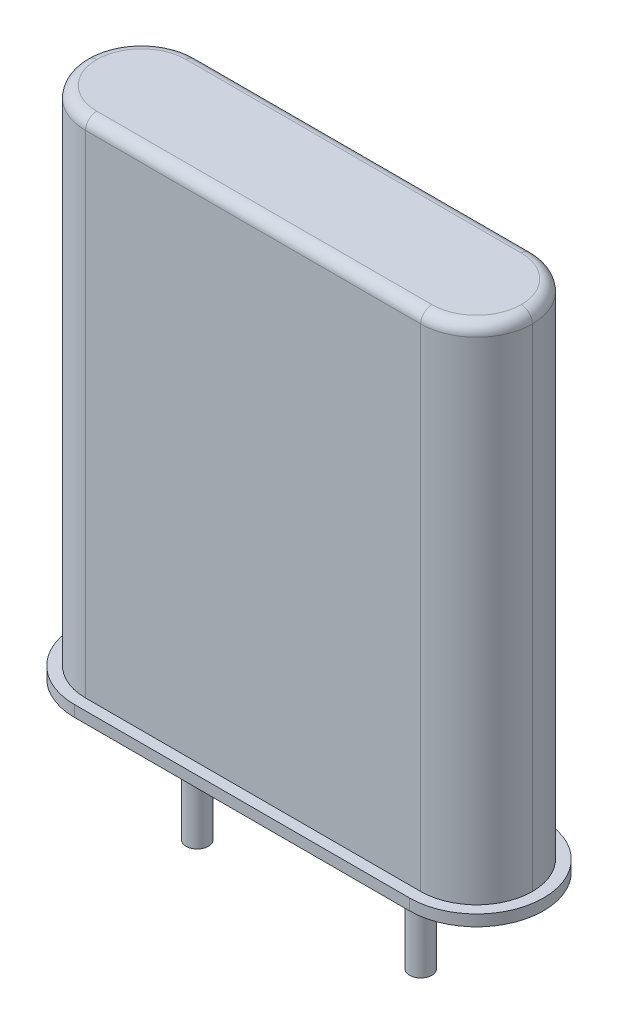
ISO-10303-21;
HEADER;
FILE_DESCRIPTION(('STEP AP214'),'2;1');
FILE_NAME('part.step','',(''),(''),'','','');
FILE_SCHEMA(('AUTOMOTIVE_DESIGN { 1 0 10303 214 1 1 1 1 }'));
ENDSEC;
DATA;
#1=APPLICATION_CONTEXT('core data for automotive mechanical design processes');
#2=APPLICATION_PROTOCOL_DEFINITION('international standard','automotive_design',2000,#1);
#3=PRODUCT_CONTEXT('',#1,'mechanical');
#4=PRODUCT('Part','Part','',(#3));
#5=PRODUCT_RELATED_PRODUCT_CATEGORY('part','',(#4));
#6=PRODUCT_DEFINITION_FORMATION('','',#4);
#7=PRODUCT_DEFINITION_CONTEXT('part definition',#1,'design');
#8=PRODUCT_DEFINITION('design','',#6,#7);
#9=PRODUCT_DEFINITION_SHAPE('','',#8);
#10=(LENGTH_UNIT() NAMED_UNIT(*) SI_UNIT(.MILLI.,.METRE.));
#11=(NAMED_UNIT(*) PLANE_ANGLE_UNIT() SI_UNIT($,.RADIAN.));
#12=(NAMED_UNIT(*) SI_UNIT($,.STERADIAN.) SOLID_ANGLE_UNIT());
#13=UNCERTAINTY_MEASURE_WITH_UNIT(LENGTH_MEASURE(1.E-05),#10,'distance_accuracy_value','');
#14=(GEOMETRIC_REPRESENTATION_CONTEXT(3) GLOBAL_UNCERTAINTY_ASSIGNED_CONTEXT((#13)) GLOBAL_UNIT_ASSIGNED_CONTEXT((#10,
#11,#12)) REPRESENTATION_CONTEXT('',''));
#15=CARTESIAN_POINT('',(0.,0.,0.));
#16=DIRECTION('',(0.,0.,1.));
#17=DIRECTION('',(1.,0.,0.));
#18=AXIS2_PLACEMENT_3D('',#15,#16,#17);
#19=CARTESIAN_POINT('',(-2.54,11.684,1.27));
#20=DIRECTION('',(0.,0.,-1.));
#21=DIRECTION('',(-1.,0.,0.));
#22=AXIS2_PLACEMENT_3D('',#19,#20,#21);
#23=PLANE('',#22);
#24=DIRECTION('',(-1.,0.,0.));
#25=VECTOR('',#24,1.);
#26=CARTESIAN_POINT('',(-2.54,0.254000000000001,1.27));
#27=LINE('',#26,#25);
#28=CARTESIAN_POINT('',(6.35,0.254000000000001,1.27));
#29=VERTEX_POINT('',#28);
#30=CARTESIAN_POINT('',(-1.27,0.254000000000001,1.27));
#31=VERTEX_POINT('',#30);
#32=EDGE_CURVE('E160',#29,#31,#27,.T.);
#33=ORIENTED_EDGE('',*,*,#32,.F.);
#34=DIRECTION('',(0.,1.,0.));
#35=VECTOR('',#34,1.);
#36=CARTESIAN_POINT('',(6.35,11.684,1.27));
#37=LINE('',#36,#35);
#38=CARTESIAN_POINT('',(6.35,11.43,1.27));
#39=VERTEX_POINT('',#38);
#40=EDGE_CURVE('E176',#29,#39,#37,.T.);
#41=ORIENTED_EDGE('',*,*,#40,.T.);
#42=DIRECTION('',(-1.,0.,0.));
#43=VECTOR('',#42,1.);
#44=CARTESIAN_POINT('',(-2.54,11.43,1.27));
#45=LINE('',#44,#43);
#46=CARTESIAN_POINT('',(-1.27,11.43,1.27));
#47=VERTEX_POINT('',#46);
#48=EDGE_CURVE('E212',#39,#47,#45,.T.);
#49=ORIENTED_EDGE('',*,*,#48,.T.);
#50=DIRECTION('',(0.,-1.,0.));
#51=VECTOR('',#50,1.);
#52=CARTESIAN_POINT('',(-1.27,11.684,1.27));
#53=LINE('',#52,#51);
#54=EDGE_CURVE('E178',#47,#31,#53,.T.);
#55=ORIENTED_EDGE('',*,*,#54,.T.);
#56=EDGE_LOOP('',(#33,#41,#49,#55));
#57=FACE_BOUND('',#56,.T.);
#58=ADVANCED_FACE('F15',(#57),#23,.F.);
#59=CARTESIAN_POINT('',(-2.54,11.684,-1.27));
#60=DIRECTION('',(0.,0.,-1.));
#61=DIRECTION('',(-1.,0.,0.));
#62=AXIS2_PLACEMENT_3D('',#59,#60,#61);
#63=PLANE('',#62);
#64=DIRECTION('',(0.,1.,0.));
#65=VECTOR('',#64,1.);
#66=CARTESIAN_POINT('',(6.35,0.,-1.27));
#67=LINE('',#66,#65);
#68=CARTESIAN_POINT('',(6.35,11.43,-1.27));
#69=VERTEX_POINT('',#68);
#70=CARTESIAN_POINT('',(6.35,0.254,-1.27));
#71=VERTEX_POINT('',#70);
#72=EDGE_CURVE('E181',#69,#71,#67,.F.);
#73=ORIENTED_EDGE('',*,*,#72,.T.);
#74=DIRECTION('',(-1.,0.,0.));
#75=VECTOR('',#74,1.);
#76=CARTESIAN_POINT('',(-2.54,0.254000000000001,-1.27));
#77=LINE('',#76,#75);
#78=CARTESIAN_POINT('',(-1.27,0.254000000000001,-1.27));
#79=VERTEX_POINT('',#78);
#80=EDGE_CURVE('E157',#71,#79,#77,.T.);
#81=ORIENTED_EDGE('',*,*,#80,.T.);
#82=DIRECTION('',(0.,-1.,0.));
#83=VECTOR('',#82,1.);
#84=CARTESIAN_POINT('',(-1.27,11.684,-1.27));
#85=LINE('',#84,#83);
#86=CARTESIAN_POINT('',(-1.27,11.43,-1.27));
#87=VERTEX_POINT('',#86);
#88=EDGE_CURVE('E184',#79,#87,#85,.F.);
#89=ORIENTED_EDGE('',*,*,#88,.T.);
#90=DIRECTION('',(-1.,0.,0.));
#91=VECTOR('',#90,1.);
#92=CARTESIAN_POINT('',(6.35,11.43,-1.27));
#93=LINE('',#92,#91);
#94=EDGE_CURVE('E203',#87,#69,#93,.F.);
#95=ORIENTED_EDGE('',*,*,#94,.T.);
#96=EDGE_LOOP('',(#73,#81,#89,#95));
#97=FACE_BOUND('',#96,.T.);
#98=ADVANCED_FACE('F251',(#97),#63,.T.);
#99=CARTESIAN_POINT('',(-1.27,0.,0.));
#100=DIRECTION('',(0.,1.,0.));
#101=DIRECTION('',(0.,0.,1.));
#102=AXIS2_PLACEMENT_3D('',#99,#100,#101);
#103=CYLINDRICAL_SURFACE('',#102,1.27);
#104=ORIENTED_EDGE('',*,*,#88,.F.);
#105=CARTESIAN_POINT('',(-1.27,0.254,0.));
#106=DIRECTION('',(0.,-1.,0.));
#107=DIRECTION('',(0.,0.,-1.));
#108=AXIS2_PLACEMENT_3D('',#105,#106,#107);
#109=CIRCLE('',#108,1.27);
#110=CARTESIAN_POINT('',(-2.54,0.254000000000001,0.));
#111=VERTEX_POINT('',#110);
#112=EDGE_CURVE('E165',#79,#111,#109,.F.);
#113=ORIENTED_EDGE('',*,*,#112,.T.);
#114=DIRECTION('',(0.,-1.,0.));
#115=VECTOR('',#114,1.);
#116=CARTESIAN_POINT('',(-2.54,0.,0.));
#117=LINE('',#116,#115);
#118=CARTESIAN_POINT('',(-2.54,11.43,0.));
#119=VERTEX_POINT('',#118);
#120=EDGE_CURVE('E173',#119,#111,#117,.T.);
#121=ORIENTED_EDGE('',*,*,#120,.F.);
#122=CARTESIAN_POINT('',(-1.27,11.43,0.));
#123=DIRECTION('',(0.,-1.,0.));
#124=DIRECTION('',(0.,0.,-1.));
#125=AXIS2_PLACEMENT_3D('',#122,#123,#124);
#126=CIRCLE('',#125,1.27);
#127=EDGE_CURVE('E24',#119,#87,#126,.T.);
#128=ORIENTED_EDGE('',*,*,#127,.T.);
#129=EDGE_LOOP('',(#104,#113,#121,#128));
#130=FACE_BOUND('',#129,.T.);
#131=ADVANCED_FACE('F246',(#130),#103,.T.);
#132=CARTESIAN_POINT('',(-1.27,11.684,0.));
#133=DIRECTION('',(0.,-1.,0.));
#134=DIRECTION('',(0.,0.,-1.));
#135=AXIS2_PLACEMENT_3D('',#132,#133,#134);
#136=CYLINDRICAL_SURFACE('',#135,1.27);
#137=ORIENTED_EDGE('',*,*,#120,.T.);
#138=CARTESIAN_POINT('',(-1.27,0.254000000000001,0.));
#139=DIRECTION('',(0.,-1.,0.));
#140=DIRECTION('',(0.,0.,-1.));
#141=AXIS2_PLACEMENT_3D('',#138,#139,#140);
#142=CIRCLE('',#141,1.27);
#143=EDGE_CURVE('E162',#111,#31,#142,.F.);
#144=ORIENTED_EDGE('',*,*,#143,.T.);
#145=ORIENTED_EDGE('',*,*,#54,.F.);
#146=CARTESIAN_POINT('',(-1.27,11.43,0.));
#147=DIRECTION('',(0.,-1.,0.));
#148=DIRECTION('',(0.,0.,-1.));
#149=AXIS2_PLACEMENT_3D('',#146,#147,#148);
#150=CIRCLE('',#149,1.27);
#151=EDGE_CURVE('E38',#47,#119,#150,.T.);
#152=ORIENTED_EDGE('',*,*,#151,.T.);
#153=EDGE_LOOP('',(#137,#144,#145,#152));
#154=FACE_BOUND('',#153,.T.);
#155=ADVANCED_FACE('F243',(#154),#136,.T.);
#156=CARTESIAN_POINT('',(6.35,0.,0.));
#157=DIRECTION('',(0.,-1.,0.));
#158=DIRECTION('',(0.,0.,-1.));
#159=AXIS2_PLACEMENT_3D('',#156,#157,#158);
#160=CYLINDRICAL_SURFACE('',#159,1.27);
#161=DIRECTION('',(0.,1.,0.));
#162=VECTOR('',#161,1.);
#163=CARTESIAN_POINT('',(7.62,11.684,0.));
#164=LINE('',#163,#162);
#165=CARTESIAN_POINT('',(7.62,0.254000000000001,0.));
#166=VERTEX_POINT('',#165);
#167=CARTESIAN_POINT('',(7.62,11.43,0.));
#168=VERTEX_POINT('',#167);
#169=EDGE_CURVE('E188',#166,#168,#164,.T.);
#170=ORIENTED_EDGE('',*,*,#169,.F.);
#171=CARTESIAN_POINT('',(6.35,0.254,0.));
#172=DIRECTION('',(0.,-1.,0.));
#173=DIRECTION('',(0.,0.,-1.));
#174=AXIS2_PLACEMENT_3D('',#171,#172,#173);
#175=CIRCLE('',#174,1.27);
#176=EDGE_CURVE('E31',#166,#71,#175,.F.);
#177=ORIENTED_EDGE('',*,*,#176,.T.);
#178=ORIENTED_EDGE('',*,*,#72,.F.);
#179=CARTESIAN_POINT('',(6.35,11.43,0.));
#180=DIRECTION('',(0.,-1.,0.));
#181=DIRECTION('',(0.,0.,-1.));
#182=AXIS2_PLACEMENT_3D('',#179,#180,#181);
#183=CIRCLE('',#182,1.27);
#184=EDGE_CURVE('E206',#69,#168,#183,.T.);
#185=ORIENTED_EDGE('',*,*,#184,.T.);
#186=EDGE_LOOP('',(#170,#177,#178,#185));
#187=FACE_BOUND('',#186,.T.);
#188=ADVANCED_FACE('F255',(#187),#160,.T.);
#189=CARTESIAN_POINT('',(6.35,11.684,0.));
#190=DIRECTION('',(0.,1.,0.));
#191=DIRECTION('',(0.,0.,1.));
#192=AXIS2_PLACEMENT_3D('',#189,#190,#191);
#193=CYLINDRICAL_SURFACE('',#192,1.27);
#194=ORIENTED_EDGE('',*,*,#40,.F.);
#195=CARTESIAN_POINT('',(6.35,0.254000000000001,0.));
#196=DIRECTION('',(0.,-1.,0.));
#197=DIRECTION('',(0.,0.,-1.));
#198=AXIS2_PLACEMENT_3D('',#195,#196,#197);
#199=CIRCLE('',#198,1.27);
#200=EDGE_CURVE('E9',#29,#166,#199,.F.);
#201=ORIENTED_EDGE('',*,*,#200,.T.);
#202=ORIENTED_EDGE('',*,*,#169,.T.);
#203=CARTESIAN_POINT('',(6.35,11.43,0.));
#204=DIRECTION('',(0.,-1.,0.));
#205=DIRECTION('',(0.,0.,-1.));
#206=AXIS2_PLACEMENT_3D('',#203,#204,#205);
#207=CIRCLE('',#206,1.27);
#208=EDGE_CURVE('E209',#168,#39,#207,.T.);
#209=ORIENTED_EDGE('',*,*,#208,.T.);
#210=EDGE_LOOP('',(#194,#201,#202,#209));
#211=FACE_BOUND('',#210,.T.);
#212=ADVANCED_FACE('F258',(#211),#193,.T.);
#213=CARTESIAN_POINT('',(-2.54,11.684,1.27));
#214=DIRECTION('',(0.,-1.,0.));
#215=DIRECTION('',(0.,0.,-1.));
#216=AXIS2_PLACEMENT_3D('',#213,#214,#215);
#217=PLANE('',#216);
#218=CARTESIAN_POINT('',(6.35,11.684,0.));
#219=DIRECTION('',(0.,-1.,0.));
#220=DIRECTION('',(0.,0.,-1.));
#221=AXIS2_PLACEMENT_3D('',#218,#219,#220);
#222=CIRCLE('',#221,1.016);
#223=CARTESIAN_POINT('',(7.366,11.684,0.));
#224=VERTEX_POINT('',#223);
#225=CARTESIAN_POINT('',(6.35,11.684,-1.016));
#226=VERTEX_POINT('',#225);
#227=EDGE_CURVE('E198',#224,#226,#222,.F.);
#228=ORIENTED_EDGE('',*,*,#227,.T.);
#229=DIRECTION('',(-1.,0.,0.));
#230=VECTOR('',#229,1.);
#231=CARTESIAN_POINT('',(-1.27,11.684,-1.016));
#232=LINE('',#231,#230);
#233=CARTESIAN_POINT('',(-1.27,11.684,-1.016));
#234=VERTEX_POINT('',#233);
#235=EDGE_CURVE('E200',#226,#234,#232,.T.);
#236=ORIENTED_EDGE('',*,*,#235,.T.);
#237=CARTESIAN_POINT('',(-1.27,11.684,0.));
#238=DIRECTION('',(0.,-1.,0.));
#239=DIRECTION('',(0.,0.,-1.));
#240=AXIS2_PLACEMENT_3D('',#237,#238,#239);
#241=CIRCLE('',#240,1.016);
#242=CARTESIAN_POINT('',(-2.286,11.684,0.));
#243=VERTEX_POINT('',#242);
#244=EDGE_CURVE('E186',#234,#243,#241,.F.);
#245=ORIENTED_EDGE('',*,*,#244,.T.);
#246=CARTESIAN_POINT('',(-1.27,11.684,0.));
#247=DIRECTION('',(0.,-1.,0.));
#248=DIRECTION('',(0.,0.,-1.));
#249=AXIS2_PLACEMENT_3D('',#246,#247,#248);
#250=CIRCLE('',#249,1.016);
#251=CARTESIAN_POINT('',(-1.27,11.684,1.016));
#252=VERTEX_POINT('',#251);
#253=EDGE_CURVE('E192',#243,#252,#250,.F.);
#254=ORIENTED_EDGE('',*,*,#253,.T.);
#255=DIRECTION('',(-1.,0.,0.));
#256=VECTOR('',#255,1.);
#257=CARTESIAN_POINT('',(-2.54,11.684,1.016));
#258=LINE('',#257,#256);
#259=CARTESIAN_POINT('',(6.35,11.684,1.016));
#260=VERTEX_POINT('',#259);
#261=EDGE_CURVE('E194',#252,#260,#258,.F.);
#262=ORIENTED_EDGE('',*,*,#261,.T.);
#263=CARTESIAN_POINT('',(6.35,11.684,0.));
#264=DIRECTION('',(0.,-1.,0.));
#265=DIRECTION('',(0.,0.,-1.));
#266=AXIS2_PLACEMENT_3D('',#263,#264,#265);
#267=CIRCLE('',#266,1.016);
#268=EDGE_CURVE('E196',#260,#224,#267,.F.);
#269=ORIENTED_EDGE('',*,*,#268,.T.);
#270=EDGE_LOOP('',(#228,#236,#245,#254,#262,#269));
#271=FACE_BOUND('',#270,.T.);
#272=ADVANCED_FACE('F260',(#271),#217,.F.);
#273=CARTESIAN_POINT('',(-2.54,11.43,1.016));
#274=DIRECTION('',(-1.,0.,0.));
#275=DIRECTION('',(0.,0.,1.));
#276=AXIS2_PLACEMENT_3D('',#273,#274,#275);
#277=CYLINDRICAL_SURFACE('',#276,0.254);
#278=CARTESIAN_POINT('',(-1.27,11.43,1.016));
#279=DIRECTION('',(-1.,0.,0.));
#280=DIRECTION('',(0.,0.,1.));
#281=AXIS2_PLACEMENT_3D('',#278,#279,#280);
#282=CIRCLE('',#281,0.254);
#283=EDGE_CURVE('E226',#47,#252,#282,.T.);
#284=ORIENTED_EDGE('',*,*,#283,.F.);
#285=ORIENTED_EDGE('',*,*,#48,.F.);
#286=CARTESIAN_POINT('',(6.35,11.43,1.016));
#287=DIRECTION('',(1.,0.,0.));
#288=DIRECTION('',(0.,0.,-1.));
#289=AXIS2_PLACEMENT_3D('',#286,#287,#288);
#290=CIRCLE('',#289,0.254);
#291=EDGE_CURVE('E190',#260,#39,#290,.T.);
#292=ORIENTED_EDGE('',*,*,#291,.F.);
#293=ORIENTED_EDGE('',*,*,#261,.F.);
#294=EDGE_LOOP('',(#284,#285,#292,#293));
#295=FACE_BOUND('',#294,.T.);
#296=ADVANCED_FACE('F17',(#295),#277,.T.);
#297=CARTESIAN_POINT('',(6.35,11.43,0.));
#298=DIRECTION('',(0.,-1.,0.));
#299=DIRECTION('',(0.,0.,-1.));
#300=AXIS2_PLACEMENT_3D('',#297,#298,#299);
#301=TOROIDAL_SURFACE('',#300,1.016,0.254);
#302=ORIENTED_EDGE('',*,*,#291,.T.);
#303=ORIENTED_EDGE('',*,*,#208,.F.);
#304=CARTESIAN_POINT('',(7.366,11.43,0.));
#305=DIRECTION('',(0.,0.,-1.));
#306=DIRECTION('',(-1.,0.,0.));
#307=AXIS2_PLACEMENT_3D('',#304,#305,#306);
#308=CIRCLE('',#307,0.254);
#309=EDGE_CURVE('E223',#224,#168,#308,.T.);
#310=ORIENTED_EDGE('',*,*,#309,.F.);
#311=ORIENTED_EDGE('',*,*,#268,.F.);
#312=EDGE_LOOP('',(#302,#303,#310,#311));
#313=FACE_BOUND('',#312,.T.);
#314=ADVANCED_FACE('F234',(#313),#301,.T.);
#315=CARTESIAN_POINT('',(-1.27,11.43,0.));
#316=DIRECTION('',(0.,-1.,0.));
#317=DIRECTION('',(0.,0.,-1.));
#318=AXIS2_PLACEMENT_3D('',#315,#316,#317);
#319=TOROIDAL_SURFACE('',#318,1.016,0.254);
#320=ORIENTED_EDGE('',*,*,#283,.T.);
#321=ORIENTED_EDGE('',*,*,#253,.F.);
#322=CARTESIAN_POINT('',(-2.286,11.43,0.));
#323=DIRECTION('',(0.,0.,-1.));
#324=DIRECTION('',(-1.,0.,0.));
#325=AXIS2_PLACEMENT_3D('',#322,#323,#324);
#326=CIRCLE('',#325,0.254);
#327=EDGE_CURVE('E220',#119,#243,#326,.T.);
#328=ORIENTED_EDGE('',*,*,#327,.F.);
#329=ORIENTED_EDGE('',*,*,#151,.F.);
#330=EDGE_LOOP('',(#320,#321,#328,#329));
#331=FACE_BOUND('',#330,.T.);
#332=ADVANCED_FACE('F343',(#331),#319,.T.);
#333=CARTESIAN_POINT('',(6.35,11.43,0.));
#334=DIRECTION('',(0.,-1.,0.));
#335=DIRECTION('',(0.,0.,-1.));
#336=AXIS2_PLACEMENT_3D('',#333,#334,#335);
#337=TOROIDAL_SURFACE('',#336,1.016,0.254);
#338=ORIENTED_EDGE('',*,*,#309,.T.);
#339=ORIENTED_EDGE('',*,*,#184,.F.);
#340=CARTESIAN_POINT('',(6.35,11.43,-1.016));
#341=DIRECTION('',(-1.,0.,0.));
#342=DIRECTION('',(0.,0.,1.));
#343=AXIS2_PLACEMENT_3D('',#340,#341,#342);
#344=CIRCLE('',#343,0.254);
#345=EDGE_CURVE('E218',#226,#69,#344,.T.);
#346=ORIENTED_EDGE('',*,*,#345,.F.);
#347=ORIENTED_EDGE('',*,*,#227,.F.);
#348=EDGE_LOOP('',(#338,#339,#346,#347));
#349=FACE_BOUND('',#348,.T.);
#350=ADVANCED_FACE('F351',(#349),#337,.T.);
#351=CARTESIAN_POINT('',(-1.27,11.43,0.));
#352=DIRECTION('',(0.,-1.,0.));
#353=DIRECTION('',(0.,0.,-1.));
#354=AXIS2_PLACEMENT_3D('',#351,#352,#353);
#355=TOROIDAL_SURFACE('',#354,1.016,0.254);
#356=ORIENTED_EDGE('',*,*,#327,.T.);
#357=ORIENTED_EDGE('',*,*,#244,.F.);
#358=CARTESIAN_POINT('',(-1.27,11.43,-1.016));
#359=DIRECTION('',(1.,0.,0.));
#360=DIRECTION('',(0.,0.,-1.));
#361=AXIS2_PLACEMENT_3D('',#358,#359,#360);
#362=CIRCLE('',#361,0.254);
#363=EDGE_CURVE('E168',#87,#234,#362,.T.);
#364=ORIENTED_EDGE('',*,*,#363,.F.);
#365=ORIENTED_EDGE('',*,*,#127,.F.);
#366=EDGE_LOOP('',(#356,#357,#364,#365));
#367=FACE_BOUND('',#366,.T.);
#368=ADVANCED_FACE('F361',(#367),#355,.T.);
#369=CARTESIAN_POINT('',(-2.54,11.43,-1.016));
#370=DIRECTION('',(1.,0.,0.));
#371=DIRECTION('',(0.,0.,-1.));
#372=AXIS2_PLACEMENT_3D('',#369,#370,#371);
#373=CYLINDRICAL_SURFACE('',#372,0.254);
#374=ORIENTED_EDGE('',*,*,#345,.T.);
#375=ORIENTED_EDGE('',*,*,#94,.F.);
#376=ORIENTED_EDGE('',*,*,#363,.T.);
#377=ORIENTED_EDGE('',*,*,#235,.F.);
#378=EDGE_LOOP('',(#374,#375,#376,#377));
#379=FACE_BOUND('',#378,.T.);
#380=ADVANCED_FACE('F371',(#379),#373,.T.);
#381=CARTESIAN_POINT('',(6.35,0.254,0.));
#382=DIRECTION('',(0.,-1.,0.));
#383=DIRECTION('',(0.,0.,-1.));
#384=AXIS2_PLACEMENT_3D('',#381,#382,#383);
#385=CYLINDRICAL_SURFACE('',#384,1.524);
#386=CARTESIAN_POINT('',(6.35,0.,0.));
#387=DIRECTION('',(0.,-1.,0.));
#388=DIRECTION('',(0.,0.,-1.));
#389=AXIS2_PLACEMENT_3D('',#386,#387,#388);
#390=CIRCLE('',#389,1.524);
#391=CARTESIAN_POINT('',(6.35,0.,-1.524));
#392=VERTEX_POINT('',#391);
#393=CARTESIAN_POINT('',(6.35,0.,1.524));
#394=VERTEX_POINT('',#393);
#395=EDGE_CURVE('E137',#392,#394,#390,.T.);
#396=ORIENTED_EDGE('',*,*,#395,.F.);
#397=DIRECTION('',(0.,-1.,0.));
#398=VECTOR('',#397,1.);
#399=CARTESIAN_POINT('',(6.35,0.254,-1.524));
#400=LINE('',#399,#398);
#401=CARTESIAN_POINT('',(6.35,0.254,-1.524));
#402=VERTEX_POINT('',#401);
#403=EDGE_CURVE('E135',#402,#392,#400,.T.);
#404=ORIENTED_EDGE('',*,*,#403,.F.);
#405=CARTESIAN_POINT('',(6.35,0.254,0.));
#406=DIRECTION('',(0.,-1.,0.));
#407=DIRECTION('',(0.,0.,-1.));
#408=AXIS2_PLACEMENT_3D('',#405,#406,#407);
#409=CIRCLE('',#408,1.524);
#410=CARTESIAN_POINT('',(6.35,0.254,1.524));
#411=VERTEX_POINT('',#410);
#412=EDGE_CURVE('E130',#402,#411,#409,.T.);
#413=ORIENTED_EDGE('',*,*,#412,.T.);
#414=DIRECTION('',(0.,-1.,0.));
#415=VECTOR('',#414,1.);
#416=CARTESIAN_POINT('',(6.35,0.254,1.524));
#417=LINE('',#416,#415);
#418=EDGE_CURVE('E113',#411,#394,#417,.T.);
#419=ORIENTED_EDGE('',*,*,#418,.T.);
#420=EDGE_LOOP('',(#396,#404,#413,#419));
#421=FACE_BOUND('',#420,.T.);
#422=ADVANCED_FACE('F134',(#421),#385,.T.);
#423=CARTESIAN_POINT('',(-1.27,0.254,-1.524));
#424=DIRECTION('',(0.,0.,-1.));
#425=DIRECTION('',(-1.,0.,0.));
#426=AXIS2_PLACEMENT_3D('',#423,#424,#425);
#427=PLANE('',#426);
#428=DIRECTION('',(1.,0.,0.));
#429=VECTOR('',#428,1.);
#430=CARTESIAN_POINT('',(-1.27,0.,-1.524));
#431=LINE('',#430,#429);
#432=CARTESIAN_POINT('',(-1.27,0.,-1.524));
#433=VERTEX_POINT('',#432);
#434=EDGE_CURVE('E139',#433,#392,#431,.T.);
#435=ORIENTED_EDGE('',*,*,#434,.F.);
#436=DIRECTION('',(0.,-1.,0.));
#437=VECTOR('',#436,1.);
#438=CARTESIAN_POINT('',(-1.27,0.254,-1.524));
#439=LINE('',#438,#437);
#440=CARTESIAN_POINT('',(-1.27,0.254,-1.524));
#441=VERTEX_POINT('',#440);
#442=EDGE_CURVE('E153',#441,#433,#439,.T.);
#443=ORIENTED_EDGE('',*,*,#442,.F.);
#444=DIRECTION('',(1.,0.,0.));
#445=VECTOR('',#444,1.);
#446=CARTESIAN_POINT('',(-1.27,0.254,-1.524));
#447=LINE('',#446,#445);
#448=EDGE_CURVE('E124',#441,#402,#447,.T.);
#449=ORIENTED_EDGE('',*,*,#448,.T.);
#450=ORIENTED_EDGE('',*,*,#403,.T.);
#451=EDGE_LOOP('',(#435,#443,#449,#450));
#452=FACE_BOUND('',#451,.T.);
#453=ADVANCED_FACE('F390',(#452),#427,.T.);
#454=CARTESIAN_POINT('',(-1.27,0.254,0.));
#455=DIRECTION('',(0.,-1.,0.));
#456=DIRECTION('',(0.,0.,-1.));
#457=AXIS2_PLACEMENT_3D('',#454,#455,#456);
#458=CYLINDRICAL_SURFACE('',#457,1.524);
#459=CARTESIAN_POINT('',(-1.27,0.,0.));
#460=DIRECTION('',(0.,-1.,0.));
#461=DIRECTION('',(0.,0.,-1.));
#462=AXIS2_PLACEMENT_3D('',#459,#460,#461);
#463=CIRCLE('',#462,1.524);
#464=CARTESIAN_POINT('',(-1.27,0.,1.524));
#465=VERTEX_POINT('',#464);
#466=EDGE_CURVE('E147',#465,#433,#463,.T.);
#467=ORIENTED_EDGE('',*,*,#466,.F.);
#468=DIRECTION('',(0.,-1.,0.));
#469=VECTOR('',#468,1.);
#470=CARTESIAN_POINT('',(-1.27,0.254,1.524));
#471=LINE('',#470,#469);
#472=CARTESIAN_POINT('',(-1.27,0.254,1.524));
#473=VERTEX_POINT('',#472);
#474=EDGE_CURVE('E123',#473,#465,#471,.T.);
#475=ORIENTED_EDGE('',*,*,#474,.F.);
#476=CARTESIAN_POINT('',(-1.27,0.254,0.));
#477=DIRECTION('',(0.,-1.,0.));
#478=DIRECTION('',(0.,0.,-1.));
#479=AXIS2_PLACEMENT_3D('',#476,#477,#478);
#480=CIRCLE('',#479,1.524);
#481=EDGE_CURVE('E132',#473,#441,#480,.T.);
#482=ORIENTED_EDGE('',*,*,#481,.T.);
#483=ORIENTED_EDGE('',*,*,#442,.T.);
#484=EDGE_LOOP('',(#467,#475,#482,#483));
#485=FACE_BOUND('',#484,.T.);
#486=ADVANCED_FACE('F399',(#485),#458,.T.);
#487=CARTESIAN_POINT('',(6.35,0.254,1.524));
#488=DIRECTION('',(0.,0.,1.));
#489=DIRECTION('',(1.,0.,0.));
#490=AXIS2_PLACEMENT_3D('',#487,#488,#489);
#491=PLANE('',#490);
#492=DIRECTION('',(-1.,0.,0.));
#493=VECTOR('',#492,1.);
#494=CARTESIAN_POINT('',(6.35,0.,1.524));
#495=LINE('',#494,#493);
#496=EDGE_CURVE('E119',#394,#465,#495,.T.);
#497=ORIENTED_EDGE('',*,*,#496,.F.);
#498=ORIENTED_EDGE('',*,*,#418,.F.);
#499=DIRECTION('',(-1.,0.,0.));
#500=VECTOR('',#499,1.);
#501=CARTESIAN_POINT('',(6.35,0.254,1.524));
#502=LINE('',#501,#500);
#503=EDGE_CURVE('E117',#411,#473,#502,.T.);
#504=ORIENTED_EDGE('',*,*,#503,.T.);
#505=ORIENTED_EDGE('',*,*,#474,.T.);
#506=EDGE_LOOP('',(#497,#498,#504,#505));
#507=FACE_BOUND('',#506,.T.);
#508=ADVANCED_FACE('F115',(#507),#491,.T.);
#509=CARTESIAN_POINT('',(6.35,0.254,0.));
#510=DIRECTION('',(0.,-1.,0.));
#511=DIRECTION('',(0.,0.,-1.));
#512=AXIS2_PLACEMENT_3D('',#509,#510,#511);
#513=PLANE('',#512);
#514=ORIENTED_EDGE('',*,*,#112,.F.);
#515=ORIENTED_EDGE('',*,*,#80,.F.);
#516=ORIENTED_EDGE('',*,*,#176,.F.);
#517=ORIENTED_EDGE('',*,*,#200,.F.);
#518=ORIENTED_EDGE('',*,*,#32,.T.);
#519=ORIENTED_EDGE('',*,*,#143,.F.);
#520=EDGE_LOOP('',(#514,#515,#516,#517,#518,#519));
#521=FACE_BOUND('',#520,.T.);
#522=ORIENTED_EDGE('',*,*,#412,.F.);
#523=ORIENTED_EDGE('',*,*,#448,.F.);
#524=ORIENTED_EDGE('',*,*,#481,.F.);
#525=ORIENTED_EDGE('',*,*,#503,.F.);
#526=EDGE_LOOP('',(#522,#523,#524,#525));
#527=FACE_BOUND('',#526,.T.);
#528=ADVANCED_FACE('F128',(#521,#527),#513,.F.);
#529=CARTESIAN_POINT('',(0.,-2.54,0.));
#530=DIRECTION('',(0.,-1.,0.));
#531=DIRECTION('',(0.,0.,-1.));
#532=AXIS2_PLACEMENT_3D('',#529,#530,#531);
#533=PLANE('',#532);
#534=CARTESIAN_POINT('',(0.,-2.54,0.));
#535=DIRECTION('',(0.,-1.,0.));
#536=DIRECTION('',(0.,0.,-1.));
#537=AXIS2_PLACEMENT_3D('',#534,#535,#536);
#538=CIRCLE('',#537,0.254);
#539=CARTESIAN_POINT('',(0.,-2.54,-0.254));
#540=VERTEX_POINT('',#539);
#541=EDGE_CURVE('E169',#540,#540,#538,.T.);
#542=ORIENTED_EDGE('',*,*,#541,.T.);
#543=EDGE_LOOP('',(#542));
#544=FACE_BOUND('',#543,.T.);
#545=ADVANCED_FACE('F286',(#544),#533,.T.);
#546=CARTESIAN_POINT('',(0.,-2.54,0.));
#547=DIRECTION('',(0.,1.,0.));
#548=DIRECTION('',(0.,0.,1.));
#549=AXIS2_PLACEMENT_3D('',#546,#547,#548);
#550=CYLINDRICAL_SURFACE('',#549,0.254);
#551=ORIENTED_EDGE('',*,*,#541,.F.);
#552=EDGE_LOOP('',(#551));
#553=FACE_BOUND('',#552,.T.);
#554=CARTESIAN_POINT('',(0.,0.,0.));
#555=DIRECTION('',(0.,1.,0.));
#556=DIRECTION('',(0.,0.,1.));
#557=AXIS2_PLACEMENT_3D('',#554,#555,#556);
#558=CIRCLE('',#557,0.254);
#559=CARTESIAN_POINT('',(0.,0.,0.254));
#560=VERTEX_POINT('',#559);
#561=EDGE_CURVE('E172',#560,#560,#558,.T.);
#562=ORIENTED_EDGE('',*,*,#561,.F.);
#563=EDGE_LOOP('',(#562));
#564=FACE_BOUND('',#563,.T.);
#565=ADVANCED_FACE('F284',(#553,#564),#550,.T.);
#566=CARTESIAN_POINT('',(-2.54,0.,1.27));
#567=DIRECTION('',(0.,1.,0.));
#568=DIRECTION('',(0.,0.,1.));
#569=AXIS2_PLACEMENT_3D('',#566,#567,#568);
#570=PLANE('',#569);
#571=CARTESIAN_POINT('',(5.08,0.,0.));
#572=DIRECTION('',(0.,1.,0.));
#573=DIRECTION('',(0.,0.,1.));
#574=AXIS2_PLACEMENT_3D('',#571,#572,#573);
#575=CIRCLE('',#574,0.254);
#576=CARTESIAN_POINT('',(5.08,0.,0.254));
#577=VERTEX_POINT('',#576);
#578=EDGE_CURVE('E19',#577,#577,#575,.T.);
#579=ORIENTED_EDGE('',*,*,#578,.T.);
#580=EDGE_LOOP('',(#579));
#581=FACE_BOUND('',#580,.T.);
#582=ORIENTED_EDGE('',*,*,#561,.T.);
#583=EDGE_LOOP('',(#582));
#584=FACE_BOUND('',#583,.T.);
#585=ORIENTED_EDGE('',*,*,#395,.T.);
#586=ORIENTED_EDGE('',*,*,#496,.T.);
#587=ORIENTED_EDGE('',*,*,#466,.T.);
#588=ORIENTED_EDGE('',*,*,#434,.T.);
#589=EDGE_LOOP('',(#585,#586,#587,#588));
#590=FACE_BOUND('',#589,.T.);
#591=ADVANCED_FACE('F280',(#581,#584,#590),#570,.F.);
#592=CARTESIAN_POINT('',(5.08,-2.54,0.));
#593=DIRECTION('',(0.,1.,0.));
#594=DIRECTION('',(0.,0.,1.));
#595=AXIS2_PLACEMENT_3D('',#592,#593,#594);
#596=CYLINDRICAL_SURFACE('',#595,0.254);
#597=CARTESIAN_POINT('',(5.08,-2.54,0.));
#598=DIRECTION('',(0.,1.,0.));
#599=DIRECTION('',(0.,0.,-1.));
#600=AXIS2_PLACEMENT_3D('',#597,#598,#599);
#601=CIRCLE('',#600,0.254);
#602=CARTESIAN_POINT('',(5.08,-2.54,-0.254));
#603=VERTEX_POINT('',#602);
#604=EDGE_CURVE('E142',#603,#603,#601,.T.);
#605=ORIENTED_EDGE('',*,*,#604,.T.);
#606=EDGE_LOOP('',(#605));
#607=FACE_BOUND('',#606,.T.);
#608=ORIENTED_EDGE('',*,*,#578,.F.);
#609=EDGE_LOOP('',(#608));
#610=FACE_BOUND('',#609,.T.);
#611=ADVANCED_FACE('F283',(#607,#610),#596,.T.);
#612=CARTESIAN_POINT('',(5.08,-2.54,0.));
#613=DIRECTION('',(0.,-1.,0.));
#614=DIRECTION('',(0.,0.,-1.));
#615=AXIS2_PLACEMENT_3D('',#612,#613,#614);
#616=PLANE('',#615);
#617=ORIENTED_EDGE('',*,*,#604,.F.);
#618=EDGE_LOOP('',(#617));
#619=FACE_BOUND('',#618,.T.);
#620=ADVANCED_FACE('F451',(#619),#616,.T.);
#621=CLOSED_SHELL('',(#58,#98,#131,#155,#188,#212,#272,#296,#314,#332,#350,#368,#380,#422,#453,
#486,#508,#528,#545,#565,#591,#611,#620));
#622=MANIFOLD_SOLID_BREP('B1',#621);
#623=ADVANCED_BREP_SHAPE_REPRESENTATION('',(#18,#622),#14);
#624=SHAPE_DEFINITION_REPRESENTATION(#9,#623);
ENDSEC;
END-ISO-10303-21;
